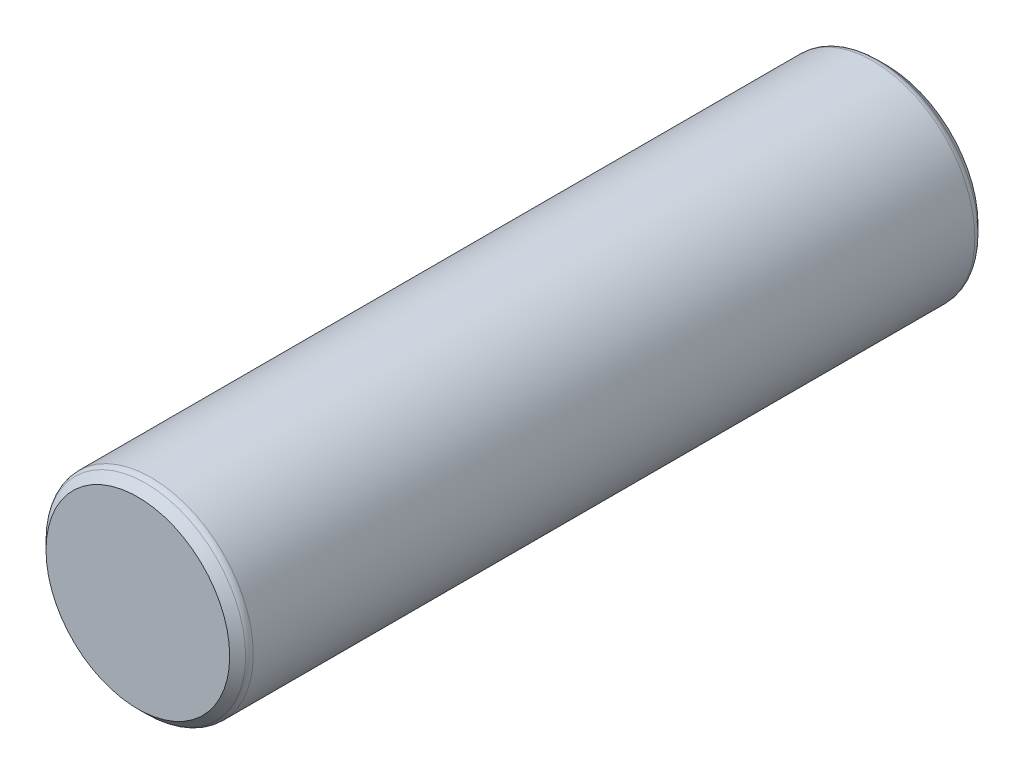
ISO-10303-21;
HEADER;
FILE_DESCRIPTION(('STEP AP214'),'2;1');
FILE_NAME('part.step','',(''),(''),'','','');
FILE_SCHEMA(('AUTOMOTIVE_DESIGN { 1 0 10303 214 1 1 1 1 }'));
ENDSEC;
DATA;
#1=APPLICATION_CONTEXT('core data for automotive mechanical design processes');
#2=APPLICATION_PROTOCOL_DEFINITION('international standard','automotive_design',2000,#1);
#3=PRODUCT_CONTEXT('',#1,'mechanical');
#4=PRODUCT('Part','Part','',(#3));
#5=PRODUCT_RELATED_PRODUCT_CATEGORY('part','',(#4));
#6=PRODUCT_DEFINITION_FORMATION('','',#4);
#7=PRODUCT_DEFINITION_CONTEXT('part definition',#1,'design');
#8=PRODUCT_DEFINITION('design','',#6,#7);
#9=PRODUCT_DEFINITION_SHAPE('','',#8);
#10=(LENGTH_UNIT() NAMED_UNIT(*) SI_UNIT(.MILLI.,.METRE.));
#11=(NAMED_UNIT(*) PLANE_ANGLE_UNIT() SI_UNIT($,.RADIAN.));
#12=(NAMED_UNIT(*) SI_UNIT($,.STERADIAN.) SOLID_ANGLE_UNIT());
#13=UNCERTAINTY_MEASURE_WITH_UNIT(LENGTH_MEASURE(1.E-05),#10,'distance_accuracy_value','');
#14=(GEOMETRIC_REPRESENTATION_CONTEXT(3) GLOBAL_UNCERTAINTY_ASSIGNED_CONTEXT((#13)) GLOBAL_UNIT_ASSIGNED_CONTEXT((#10,
#11,#12)) REPRESENTATION_CONTEXT('',''));
#15=CARTESIAN_POINT('',(0.,0.,0.));
#16=DIRECTION('',(0.,0.,1.));
#17=DIRECTION('',(1.,0.,0.));
#18=AXIS2_PLACEMENT_3D('',#15,#16,#17);
#19=CARTESIAN_POINT('',(0.,0.,27.5));
#20=DIRECTION('',(0.,0.,-1.));
#21=DIRECTION('',(-1.,0.,0.));
#22=AXIS2_PLACEMENT_3D('',#19,#20,#21);
#23=CYLINDRICAL_SURFACE('',#22,7.5);
#24=CARTESIAN_POINT('',(0.,0.,26.5170048711651));
#25=DIRECTION('',(0.,0.,1.));
#26=DIRECTION('',(1.,0.,0.));
#27=AXIS2_PLACEMENT_3D('',#24,#25,#26);
#28=CIRCLE('',#27,7.5);
#29=CARTESIAN_POINT('',(7.5,0.,26.5170048711651));
#30=VERTEX_POINT('',#29);
#31=EDGE_CURVE('E50',#30,#30,#28,.F.);
#32=ORIENTED_EDGE('',*,*,#31,.T.);
#33=EDGE_LOOP('',(#32));
#34=FACE_BOUND('',#33,.T.);
#35=CARTESIAN_POINT('',(0.,0.,-26.5170048711651));
#36=DIRECTION('',(0.,0.,-1.));
#37=DIRECTION('',(-1.,0.,0.));
#38=AXIS2_PLACEMENT_3D('',#35,#36,#37);
#39=CIRCLE('',#38,7.5);
#40=CARTESIAN_POINT('',(-7.5,0.,-26.5170048711651));
#41=VERTEX_POINT('',#40);
#42=EDGE_CURVE('E54',#41,#41,#39,.F.);
#43=ORIENTED_EDGE('',*,*,#42,.T.);
#44=EDGE_LOOP('',(#43));
#45=FACE_BOUND('',#44,.T.);
#46=ADVANCED_FACE('F39',(#34,#45),#23,.T.);
#47=CARTESIAN_POINT('',(0.,0.,27.5));
#48=DIRECTION('',(0.,0.,1.));
#49=DIRECTION('',(1.,0.,0.));
#50=AXIS2_PLACEMENT_3D('',#47,#48,#49);
#51=PLANE('',#50);
#52=CARTESIAN_POINT('',(0.,0.,27.5));
#53=DIRECTION('',(0.,0.,1.));
#54=DIRECTION('',(1.,0.,0.));
#55=AXIS2_PLACEMENT_3D('',#52,#53,#54);
#56=CIRCLE('',#55,6.75000000000001);
#57=CARTESIAN_POINT('',(6.75000000000001,0.,27.5));
#58=VERTEX_POINT('',#57);
#59=EDGE_CURVE('E62',#58,#58,#56,.T.);
#60=ORIENTED_EDGE('',*,*,#59,.T.);
#61=EDGE_LOOP('',(#60));
#62=FACE_BOUND('',#61,.T.);
#63=ADVANCED_FACE('F66',(#62),#51,.T.);
#64=CARTESIAN_POINT('',(0.,0.,-27.5));
#65=DIRECTION('',(0.,0.,1.));
#66=DIRECTION('',(1.,0.,0.));
#67=AXIS2_PLACEMENT_3D('',#64,#65,#66);
#68=PLANE('',#67);
#69=CARTESIAN_POINT('',(0.,0.,-27.5));
#70=DIRECTION('',(0.,0.,1.));
#71=DIRECTION('',(1.,0.,0.));
#72=AXIS2_PLACEMENT_3D('',#69,#70,#71);
#73=CIRCLE('',#72,6.74999999999999);
#74=CARTESIAN_POINT('',(6.74999999999999,0.,-27.5));
#75=VERTEX_POINT('',#74);
#76=EDGE_CURVE('E59',#75,#75,#73,.F.);
#77=ORIENTED_EDGE('',*,*,#76,.T.);
#78=EDGE_LOOP('',(#77));
#79=FACE_BOUND('',#78,.T.);
#80=ADVANCED_FACE('F71',(#79),#68,.F.);
#81=CARTESIAN_POINT('',(0.,0.,27.5));
#82=DIRECTION('',(0.,0.,-1.));
#83=DIRECTION('',(-1.,0.,0.));
#84=AXIS2_PLACEMENT_3D('',#81,#82,#83);
#85=CONICAL_SURFACE('',#84,6.75000000000001,0.785398163397447);
#86=CARTESIAN_POINT('',(0.,0.,26.9147524355826));
#87=DIRECTION('',(0.,0.,-1.));
#88=DIRECTION('',(-1.,0.,0.));
#89=AXIS2_PLACEMENT_3D('',#86,#87,#88);
#90=CIRCLE('',#89,7.33524756441744);
#91=CARTESIAN_POINT('',(-7.33524756441744,0.,26.9147524355826));
#92=VERTEX_POINT('',#91);
#93=EDGE_CURVE('E46',#92,#92,#90,.F.);
#94=ORIENTED_EDGE('',*,*,#93,.T.);
#95=EDGE_LOOP('',(#94));
#96=FACE_BOUND('',#95,.T.);
#97=ORIENTED_EDGE('',*,*,#59,.F.);
#98=EDGE_LOOP('',(#97));
#99=FACE_BOUND('',#98,.T.);
#100=ADVANCED_FACE('F68',(#96,#99),#85,.T.);
#101=CARTESIAN_POINT('',(0.,0.,-26.75));
#102=DIRECTION('',(0.,0.,1.));
#103=DIRECTION('',(1.,0.,0.));
#104=AXIS2_PLACEMENT_3D('',#101,#102,#103);
#105=CONICAL_SURFACE('',#104,7.5,0.785398163397453);
#106=CARTESIAN_POINT('',(0.,0.,-26.9147524355826));
#107=DIRECTION('',(0.,0.,1.));
#108=DIRECTION('',(1.,0.,0.));
#109=AXIS2_PLACEMENT_3D('',#106,#107,#108);
#110=CIRCLE('',#109,7.33524756441743);
#111=CARTESIAN_POINT('',(7.33524756441743,0.,-26.9147524355826));
#112=VERTEX_POINT('',#111);
#113=EDGE_CURVE('E10',#112,#112,#110,.F.);
#114=ORIENTED_EDGE('',*,*,#113,.T.);
#115=EDGE_LOOP('',(#114));
#116=FACE_BOUND('',#115,.T.);
#117=ORIENTED_EDGE('',*,*,#76,.F.);
#118=EDGE_LOOP('',(#117));
#119=FACE_BOUND('',#118,.T.);
#120=ADVANCED_FACE('F70',(#116,#119),#105,.T.);
#121=CARTESIAN_POINT('',(0.,0.,26.5170048711651));
#122=DIRECTION('',(0.,0.,1.));
#123=DIRECTION('',(1.,0.,0.));
#124=AXIS2_PLACEMENT_3D('',#121,#122,#123);
#125=TOROIDAL_SURFACE('',#124,6.9375,0.5625);
#126=ORIENTED_EDGE('',*,*,#93,.F.);
#127=EDGE_LOOP('',(#126));
#128=FACE_BOUND('',#127,.T.);
#129=ORIENTED_EDGE('',*,*,#31,.F.);
#130=EDGE_LOOP('',(#129));
#131=FACE_BOUND('',#130,.T.);
#132=ADVANCED_FACE('F77',(#128,#131),#125,.T.);
#133=CARTESIAN_POINT('',(0.,0.,-26.5170048711651));
#134=DIRECTION('',(0.,0.,-1.));
#135=DIRECTION('',(-1.,0.,0.));
#136=AXIS2_PLACEMENT_3D('',#133,#134,#135);
#137=TOROIDAL_SURFACE('',#136,6.9375,0.5625);
#138=ORIENTED_EDGE('',*,*,#113,.F.);
#139=EDGE_LOOP('',(#138));
#140=FACE_BOUND('',#139,.T.);
#141=ORIENTED_EDGE('',*,*,#42,.F.);
#142=EDGE_LOOP('',(#141));
#143=FACE_BOUND('',#142,.T.);
#144=ADVANCED_FACE('F41',(#140,#143),#137,.T.);
#145=CLOSED_SHELL('',(#46,#63,#80,#100,#120,#132,#144));
#146=MANIFOLD_SOLID_BREP('B2',#145);
#147=ADVANCED_BREP_SHAPE_REPRESENTATION('',(#18,#146),#14);
#148=SHAPE_DEFINITION_REPRESENTATION(#9,#147);
ENDSEC;
END-ISO-10303-21;
